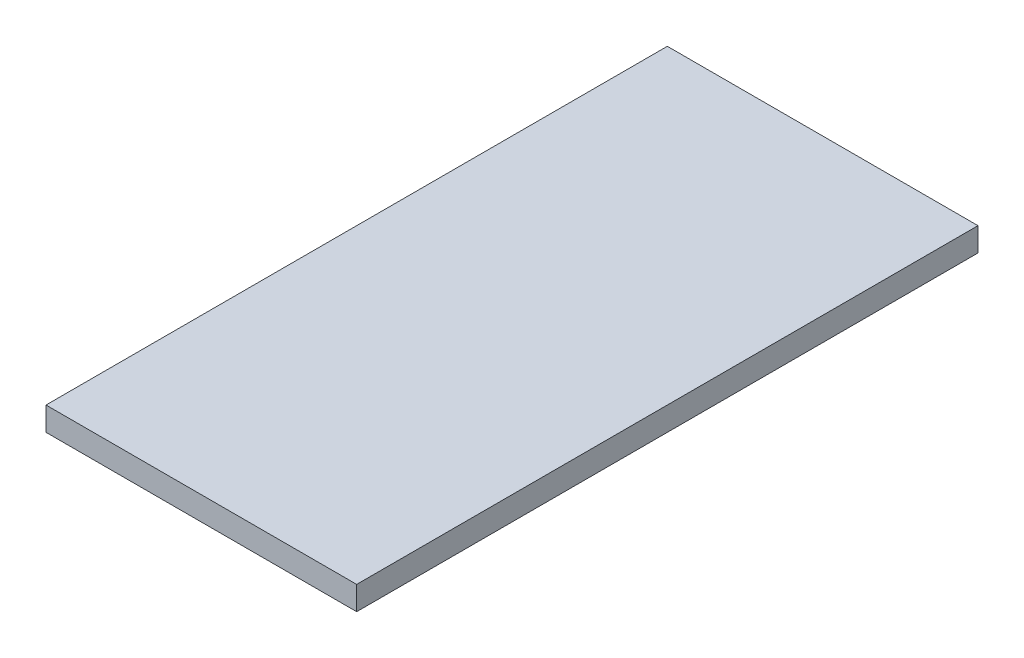
ISO-10303-21;
HEADER;
FILE_DESCRIPTION(('STEP AP214'),'2;1');
FILE_NAME('part.step','',(''),(''),'','','');
FILE_SCHEMA(('AUTOMOTIVE_DESIGN { 1 0 10303 214 1 1 1 1 }'));
ENDSEC;
DATA;
#1=APPLICATION_CONTEXT('core data for automotive mechanical design processes');
#2=APPLICATION_PROTOCOL_DEFINITION('international standard','automotive_design',2000,#1);
#3=PRODUCT_CONTEXT('',#1,'mechanical');
#4=PRODUCT('Part','Part','',(#3));
#5=PRODUCT_RELATED_PRODUCT_CATEGORY('part','',(#4));
#6=PRODUCT_DEFINITION_FORMATION('','',#4);
#7=PRODUCT_DEFINITION_CONTEXT('part definition',#1,'design');
#8=PRODUCT_DEFINITION('design','',#6,#7);
#9=PRODUCT_DEFINITION_SHAPE('','',#8);
#10=(LENGTH_UNIT() NAMED_UNIT(*) SI_UNIT(.MILLI.,.METRE.));
#11=(NAMED_UNIT(*) PLANE_ANGLE_UNIT() SI_UNIT($,.RADIAN.));
#12=(NAMED_UNIT(*) SI_UNIT($,.STERADIAN.) SOLID_ANGLE_UNIT());
#13=UNCERTAINTY_MEASURE_WITH_UNIT(LENGTH_MEASURE(1.E-05),#10,'distance_accuracy_value','');
#14=(GEOMETRIC_REPRESENTATION_CONTEXT(3) GLOBAL_UNCERTAINTY_ASSIGNED_CONTEXT((#13)) GLOBAL_UNIT_ASSIGNED_CONTEXT((#10,
#11,#12)) REPRESENTATION_CONTEXT('',''));
#15=CARTESIAN_POINT('',(0.,0.,0.));
#16=DIRECTION('',(0.,0.,1.));
#17=DIRECTION('',(1.,0.,0.));
#18=AXIS2_PLACEMENT_3D('',#15,#16,#17);
#19=CARTESIAN_POINT('',(6.35,0.96774,-12.7));
#20=DIRECTION('',(-1.,0.,0.));
#21=DIRECTION('',(0.,0.,1.));
#22=AXIS2_PLACEMENT_3D('',#19,#20,#21);
#23=PLANE('',#22);
#24=DIRECTION('',(0.,0.,-1.));
#25=VECTOR('',#24,1.);
#26=CARTESIAN_POINT('',(6.35,0.,-12.7));
#27=LINE('',#26,#25);
#28=CARTESIAN_POINT('',(6.35,0.,12.7));
#29=VERTEX_POINT('',#28);
#30=CARTESIAN_POINT('',(6.35,0.,-12.7));
#31=VERTEX_POINT('',#30);
#32=EDGE_CURVE('E100',#29,#31,#27,.T.);
#33=ORIENTED_EDGE('',*,*,#32,.T.);
#34=DIRECTION('',(0.,-1.,0.));
#35=VECTOR('',#34,1.);
#36=CARTESIAN_POINT('',(6.35,0.96774,-12.7));
#37=LINE('',#36,#35);
#38=CARTESIAN_POINT('',(6.35,0.96774,-12.7));
#39=VERTEX_POINT('',#38);
#40=EDGE_CURVE('E11',#39,#31,#37,.T.);
#41=ORIENTED_EDGE('',*,*,#40,.F.);
#42=DIRECTION('',(0.,0.,-1.));
#43=VECTOR('',#42,1.);
#44=CARTESIAN_POINT('',(6.35,0.96774,-12.7));
#45=LINE('',#44,#43);
#46=CARTESIAN_POINT('',(6.35,0.96774,12.7));
#47=VERTEX_POINT('',#46);
#48=EDGE_CURVE('E88',#47,#39,#45,.T.);
#49=ORIENTED_EDGE('',*,*,#48,.F.);
#50=DIRECTION('',(0.,-1.,0.));
#51=VECTOR('',#50,1.);
#52=CARTESIAN_POINT('',(6.35,0.96774,12.7));
#53=LINE('',#52,#51);
#54=EDGE_CURVE('E96',#47,#29,#53,.T.);
#55=ORIENTED_EDGE('',*,*,#54,.T.);
#56=EDGE_LOOP('',(#33,#41,#49,#55));
#57=FACE_BOUND('',#56,.T.);
#58=ADVANCED_FACE('F37',(#57),#23,.F.);
#59=CARTESIAN_POINT('',(-6.35,0.96774,-12.7));
#60=DIRECTION('',(0.,0.,1.));
#61=DIRECTION('',(1.,0.,0.));
#62=AXIS2_PLACEMENT_3D('',#59,#60,#61);
#63=PLANE('',#62);
#64=DIRECTION('',(-1.,0.,0.));
#65=VECTOR('',#64,1.);
#66=CARTESIAN_POINT('',(-6.35,0.,-12.7));
#67=LINE('',#66,#65);
#68=CARTESIAN_POINT('',(-6.35,0.,-12.7));
#69=VERTEX_POINT('',#68);
#70=EDGE_CURVE('E92',#31,#69,#67,.T.);
#71=ORIENTED_EDGE('',*,*,#70,.T.);
#72=DIRECTION('',(0.,-1.,0.));
#73=VECTOR('',#72,1.);
#74=CARTESIAN_POINT('',(-6.35,0.96774,-12.7));
#75=LINE('',#74,#73);
#76=CARTESIAN_POINT('',(-6.35,0.96774,-12.7));
#77=VERTEX_POINT('',#76);
#78=EDGE_CURVE('E45',#77,#69,#75,.T.);
#79=ORIENTED_EDGE('',*,*,#78,.F.);
#80=DIRECTION('',(-1.,0.,0.));
#81=VECTOR('',#80,1.);
#82=CARTESIAN_POINT('',(-6.35,0.96774,-12.7));
#83=LINE('',#82,#81);
#84=EDGE_CURVE('E83',#39,#77,#83,.T.);
#85=ORIENTED_EDGE('',*,*,#84,.F.);
#86=ORIENTED_EDGE('',*,*,#40,.T.);
#87=EDGE_LOOP('',(#71,#79,#85,#86));
#88=FACE_BOUND('',#87,.T.);
#89=ADVANCED_FACE('F91',(#88),#63,.F.);
#90=CARTESIAN_POINT('',(-6.35,0.96774,-12.7));
#91=DIRECTION('',(1.,0.,0.));
#92=DIRECTION('',(0.,0.,-1.));
#93=AXIS2_PLACEMENT_3D('',#90,#91,#92);
#94=PLANE('',#93);
#95=DIRECTION('',(0.,0.,1.));
#96=VECTOR('',#95,1.);
#97=CARTESIAN_POINT('',(-6.35,0.,-12.7));
#98=LINE('',#97,#96);
#99=CARTESIAN_POINT('',(-6.35,0.,12.7));
#100=VERTEX_POINT('',#99);
#101=EDGE_CURVE('E70',#69,#100,#98,.T.);
#102=ORIENTED_EDGE('',*,*,#101,.T.);
#103=DIRECTION('',(0.,-1.,0.));
#104=VECTOR('',#103,1.);
#105=CARTESIAN_POINT('',(-6.35,0.96774,12.7));
#106=LINE('',#105,#104);
#107=CARTESIAN_POINT('',(-6.35,0.96774,12.7));
#108=VERTEX_POINT('',#107);
#109=EDGE_CURVE('E93',#108,#100,#106,.T.);
#110=ORIENTED_EDGE('',*,*,#109,.F.);
#111=DIRECTION('',(0.,0.,1.));
#112=VECTOR('',#111,1.);
#113=CARTESIAN_POINT('',(-6.35,0.96774,-12.7));
#114=LINE('',#113,#112);
#115=EDGE_CURVE('E86',#77,#108,#114,.T.);
#116=ORIENTED_EDGE('',*,*,#115,.F.);
#117=ORIENTED_EDGE('',*,*,#78,.T.);
#118=EDGE_LOOP('',(#102,#110,#116,#117));
#119=FACE_BOUND('',#118,.T.);
#120=ADVANCED_FACE('F94',(#119),#94,.F.);
#121=CARTESIAN_POINT('',(-6.35,0.96774,12.7));
#122=DIRECTION('',(0.,0.,-1.));
#123=DIRECTION('',(-1.,0.,0.));
#124=AXIS2_PLACEMENT_3D('',#121,#122,#123);
#125=PLANE('',#124);
#126=DIRECTION('',(1.,0.,0.));
#127=VECTOR('',#126,1.);
#128=CARTESIAN_POINT('',(-6.35,0.,12.7));
#129=LINE('',#128,#127);
#130=EDGE_CURVE('E76',#100,#29,#129,.T.);
#131=ORIENTED_EDGE('',*,*,#130,.T.);
#132=ORIENTED_EDGE('',*,*,#54,.F.);
#133=DIRECTION('',(1.,0.,0.));
#134=VECTOR('',#133,1.);
#135=CARTESIAN_POINT('',(-6.35,0.96774,12.7));
#136=LINE('',#135,#134);
#137=EDGE_CURVE('E53',#108,#47,#136,.T.);
#138=ORIENTED_EDGE('',*,*,#137,.F.);
#139=ORIENTED_EDGE('',*,*,#109,.T.);
#140=EDGE_LOOP('',(#131,#132,#138,#139));
#141=FACE_BOUND('',#140,.T.);
#142=ADVANCED_FACE('F107',(#141),#125,.F.);
#143=CARTESIAN_POINT('',(6.35,0.96774,12.7));
#144=DIRECTION('',(0.,1.,0.));
#145=DIRECTION('',(0.,0.,1.));
#146=AXIS2_PLACEMENT_3D('',#143,#144,#145);
#147=PLANE('',#146);
#148=ORIENTED_EDGE('',*,*,#48,.T.);
#149=ORIENTED_EDGE('',*,*,#84,.T.);
#150=ORIENTED_EDGE('',*,*,#115,.T.);
#151=ORIENTED_EDGE('',*,*,#137,.T.);
#152=EDGE_LOOP('',(#148,#149,#150,#151));
#153=FACE_BOUND('',#152,.T.);
#154=ADVANCED_FACE('F84',(#153),#147,.T.);
#155=CARTESIAN_POINT('',(6.35,0.,12.7));
#156=DIRECTION('',(0.,1.,0.));
#157=DIRECTION('',(0.,0.,1.));
#158=AXIS2_PLACEMENT_3D('',#155,#156,#157);
#159=PLANE('',#158);
#160=ORIENTED_EDGE('',*,*,#32,.F.);
#161=ORIENTED_EDGE('',*,*,#130,.F.);
#162=ORIENTED_EDGE('',*,*,#101,.F.);
#163=ORIENTED_EDGE('',*,*,#70,.F.);
#164=EDGE_LOOP('',(#160,#161,#162,#163));
#165=FACE_BOUND('',#164,.T.);
#166=ADVANCED_FACE('F110',(#165),#159,.F.);
#167=CLOSED_SHELL('',(#58,#89,#120,#142,#154,#166));
#168=MANIFOLD_SOLID_BREP('B2',#167);
#169=ADVANCED_BREP_SHAPE_REPRESENTATION('',(#18,#168),#14);
#170=SHAPE_DEFINITION_REPRESENTATION(#9,#169);
ENDSEC;
END-ISO-10303-21;
